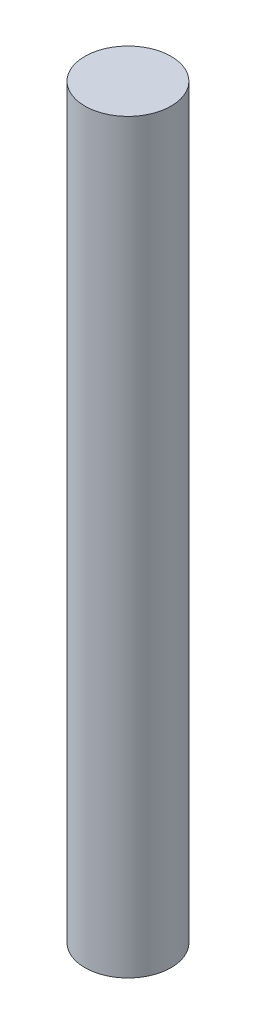
ISO-10303-21;
HEADER;
FILE_DESCRIPTION(('STEP AP214'),'2;1');
FILE_NAME('part.step','',(''),(''),'','','');
FILE_SCHEMA(('AUTOMOTIVE_DESIGN { 1 0 10303 214 1 1 1 1 }'));
ENDSEC;
DATA;
#1=APPLICATION_CONTEXT('core data for automotive mechanical design processes');
#2=APPLICATION_PROTOCOL_DEFINITION('international standard','automotive_design',2000,#1);
#3=PRODUCT_CONTEXT('',#1,'mechanical');
#4=PRODUCT('Part','Part','',(#3));
#5=PRODUCT_RELATED_PRODUCT_CATEGORY('part','',(#4));
#6=PRODUCT_DEFINITION_FORMATION('','',#4);
#7=PRODUCT_DEFINITION_CONTEXT('part definition',#1,'design');
#8=PRODUCT_DEFINITION('design','',#6,#7);
#9=PRODUCT_DEFINITION_SHAPE('','',#8);
#10=(LENGTH_UNIT() NAMED_UNIT(*) SI_UNIT(.MILLI.,.METRE.));
#11=(NAMED_UNIT(*) PLANE_ANGLE_UNIT() SI_UNIT($,.RADIAN.));
#12=(NAMED_UNIT(*) SI_UNIT($,.STERADIAN.) SOLID_ANGLE_UNIT());
#13=UNCERTAINTY_MEASURE_WITH_UNIT(LENGTH_MEASURE(1.E-05),#10,'distance_accuracy_value','');
#14=(GEOMETRIC_REPRESENTATION_CONTEXT(3) GLOBAL_UNCERTAINTY_ASSIGNED_CONTEXT((#13)) GLOBAL_UNIT_ASSIGNED_CONTEXT((#10,
#11,#12)) REPRESENTATION_CONTEXT('',''));
#15=CARTESIAN_POINT('',(0.,0.,0.));
#16=DIRECTION('',(0.,0.,1.));
#17=DIRECTION('',(1.,0.,0.));
#18=AXIS2_PLACEMENT_3D('',#15,#16,#17);
#19=CARTESIAN_POINT('',(0.,57.15,0.));
#20=DIRECTION('',(0.,-1.,0.));
#21=DIRECTION('',(0.,0.,-1.));
#22=AXIS2_PLACEMENT_3D('',#19,#20,#21);
#23=CYLINDRICAL_SURFACE('',#22,3.302);
#24=CARTESIAN_POINT('',(0.,57.15,0.));
#25=DIRECTION('',(0.,1.,0.));
#26=DIRECTION('',(0.,0.,1.));
#27=AXIS2_PLACEMENT_3D('',#24,#25,#26);
#28=CIRCLE('',#27,3.302);
#29=CARTESIAN_POINT('',(0.,57.15,3.302));
#30=VERTEX_POINT('',#29);
#31=EDGE_CURVE('E10',#30,#30,#28,.T.);
#32=ORIENTED_EDGE('',*,*,#31,.F.);
#33=EDGE_LOOP('',(#32));
#34=FACE_BOUND('',#33,.T.);
#35=CARTESIAN_POINT('',(0.,0.,0.));
#36=DIRECTION('',(0.,1.,0.));
#37=DIRECTION('',(0.,0.,1.));
#38=AXIS2_PLACEMENT_3D('',#35,#36,#37);
#39=CIRCLE('',#38,3.302);
#40=CARTESIAN_POINT('',(0.,0.,3.302));
#41=VERTEX_POINT('',#40);
#42=EDGE_CURVE('E34',#41,#41,#39,.T.);
#43=ORIENTED_EDGE('',*,*,#42,.T.);
#44=EDGE_LOOP('',(#43));
#45=FACE_BOUND('',#44,.T.);
#46=ADVANCED_FACE('F31',(#34,#45),#23,.T.);
#47=CARTESIAN_POINT('',(0.,57.15,0.));
#48=DIRECTION('',(0.,1.,0.));
#49=DIRECTION('',(0.,0.,1.));
#50=AXIS2_PLACEMENT_3D('',#47,#48,#49);
#51=PLANE('',#50);
#52=ORIENTED_EDGE('',*,*,#31,.T.);
#53=EDGE_LOOP('',(#52));
#54=FACE_BOUND('',#53,.T.);
#55=ADVANCED_FACE('F46',(#54),#51,.T.);
#56=CARTESIAN_POINT('',(0.,0.,0.));
#57=DIRECTION('',(0.,1.,0.));
#58=DIRECTION('',(0.,0.,1.));
#59=AXIS2_PLACEMENT_3D('',#56,#57,#58);
#60=PLANE('',#59);
#61=ORIENTED_EDGE('',*,*,#42,.F.);
#62=EDGE_LOOP('',(#61));
#63=FACE_BOUND('',#62,.T.);
#64=ADVANCED_FACE('F44',(#63),#60,.F.);
#65=CLOSED_SHELL('',(#46,#55,#64));
#66=MANIFOLD_SOLID_BREP('B2',#65);
#67=ADVANCED_BREP_SHAPE_REPRESENTATION('',(#18,#66),#14);
#68=SHAPE_DEFINITION_REPRESENTATION(#9,#67);
ENDSEC;
END-ISO-10303-21;
